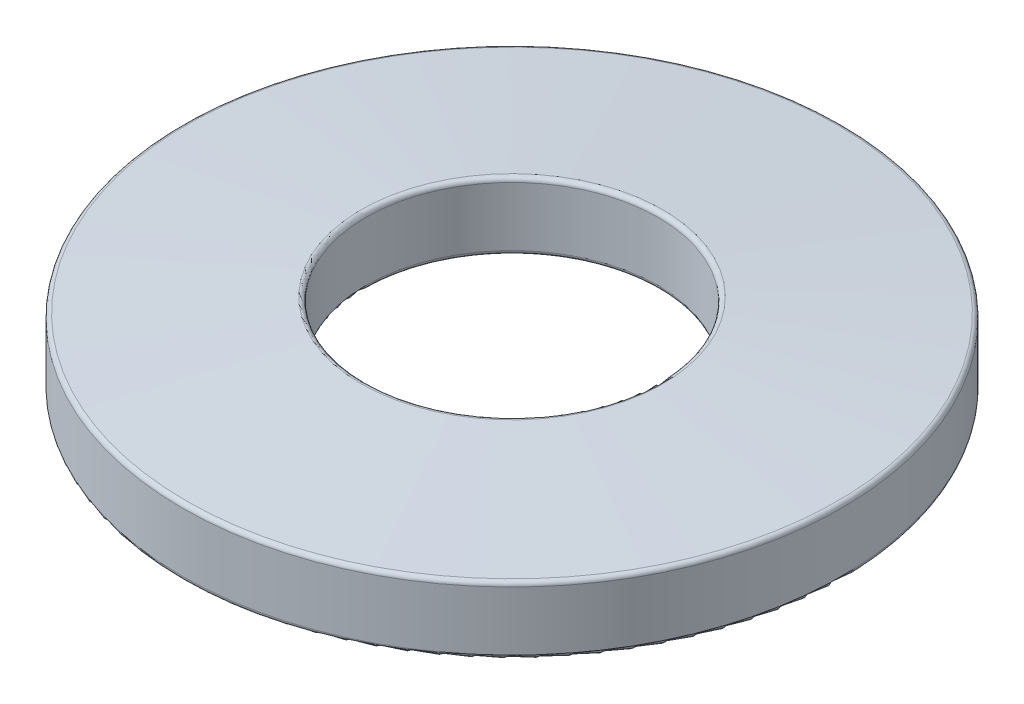
ISO-10303-21;
HEADER;
FILE_DESCRIPTION(('STEP AP214'),'2;1');
FILE_NAME('part.step','',(''),(''),'','','');
FILE_SCHEMA(('AUTOMOTIVE_DESIGN { 1 0 10303 214 1 1 1 1 }'));
ENDSEC;
DATA;
#1=APPLICATION_CONTEXT('core data for automotive mechanical design processes');
#2=APPLICATION_PROTOCOL_DEFINITION('international standard','automotive_design',2000,#1);
#3=PRODUCT_CONTEXT('',#1,'mechanical');
#4=PRODUCT('Part','Part','',(#3));
#5=PRODUCT_RELATED_PRODUCT_CATEGORY('part','',(#4));
#6=PRODUCT_DEFINITION_FORMATION('','',#4);
#7=PRODUCT_DEFINITION_CONTEXT('part definition',#1,'design');
#8=PRODUCT_DEFINITION('design','',#6,#7);
#9=PRODUCT_DEFINITION_SHAPE('','',#8);
#10=(LENGTH_UNIT() NAMED_UNIT(*) SI_UNIT(.MILLI.,.METRE.));
#11=(NAMED_UNIT(*) PLANE_ANGLE_UNIT() SI_UNIT($,.RADIAN.));
#12=(NAMED_UNIT(*) SI_UNIT($,.STERADIAN.) SOLID_ANGLE_UNIT());
#13=UNCERTAINTY_MEASURE_WITH_UNIT(LENGTH_MEASURE(1.E-05),#10,'distance_accuracy_value','');
#14=(GEOMETRIC_REPRESENTATION_CONTEXT(3) GLOBAL_UNCERTAINTY_ASSIGNED_CONTEXT((#13)) GLOBAL_UNIT_ASSIGNED_CONTEXT((#10,
#11,#12)) REPRESENTATION_CONTEXT('',''));
#15=CARTESIAN_POINT('',(0.,0.,0.));
#16=DIRECTION('',(0.,0.,1.));
#17=DIRECTION('',(1.,0.,0.));
#18=AXIS2_PLACEMENT_3D('',#15,#16,#17);
#19=CARTESIAN_POINT('',(0.,3.9624,0.));
#20=DIRECTION('',(0.,-1.,0.));
#21=DIRECTION('',(0.,0.,-1.));
#22=AXIS2_PLACEMENT_3D('',#19,#20,#21);
#23=CONICAL_SURFACE('',#22,19.304,1.49059050721893);
#24=CARTESIAN_POINT('',(0.,3.98118034265836,0.));
#25=DIRECTION('',(0.,1.,0.));
#26=DIRECTION('',(0.,0.,1.));
#27=AXIS2_PLACEMENT_3D('',#24,#25,#26);
#28=CIRCLE('',#27,19.0703504428092);
#29=CARTESIAN_POINT('',(0.,3.98118034265836,19.0703504428092));
#30=VERTEX_POINT('',#29);
#31=EDGE_CURVE('E48',#30,#30,#28,.T.);
#32=ORIENTED_EDGE('',*,*,#31,.T.);
#33=EDGE_LOOP('',(#32));
#34=FACE_BOUND('',#33,.T.);
#35=CARTESIAN_POINT('',(0.,4.80394819135812,0.));
#36=DIRECTION('',(0.,1.,0.));
#37=DIRECTION('',(0.,0.,1.));
#38=AXIS2_PLACEMENT_3D('',#35,#36,#37);
#39=CIRCLE('',#38,8.83415044280922);
#40=CARTESIAN_POINT('',(0.,4.80394819135812,8.83415044280922));
#41=VERTEX_POINT('',#40);
#42=EDGE_CURVE('E52',#41,#41,#39,.F.);
#43=ORIENTED_EDGE('',*,*,#42,.T.);
#44=EDGE_LOOP('',(#43));
#45=FACE_BOUND('',#44,.T.);
#46=ADVANCED_FACE('F37',(#34,#45),#23,.T.);
#47=CARTESIAN_POINT('',(0.,0.,0.));
#48=DIRECTION('',(0.,-1.,0.));
#49=DIRECTION('',(0.,0.,-1.));
#50=AXIS2_PLACEMENT_3D('',#47,#48,#49);
#51=CYLINDRICAL_SURFACE('',#50,8.5598);
#52=CARTESIAN_POINT('',(0.,1.09800310758566,0.));
#53=DIRECTION('',(0.,1.,0.));
#54=DIRECTION('',(0.,0.,1.));
#55=AXIS2_PLACEMENT_3D('',#52,#53,#54);
#56=CIRCLE('',#55,8.5598);
#57=CARTESIAN_POINT('',(0.,1.09800310758566,8.5598));
#58=VERTEX_POINT('',#57);
#59=EDGE_CURVE('E10',#58,#58,#56,.F.);
#60=ORIENTED_EDGE('',*,*,#59,.T.);
#61=EDGE_LOOP('',(#60));
#62=FACE_BOUND('',#61,.T.);
#63=CARTESIAN_POINT('',(0.,4.5507647411141,0.));
#64=DIRECTION('',(0.,1.,0.));
#65=DIRECTION('',(0.,0.,1.));
#66=AXIS2_PLACEMENT_3D('',#63,#64,#65);
#67=CIRCLE('',#66,8.5598);
#68=CARTESIAN_POINT('',(0.,4.5507647411141,8.5598));
#69=VERTEX_POINT('',#68);
#70=EDGE_CURVE('E44',#69,#69,#67,.T.);
#71=ORIENTED_EDGE('',*,*,#70,.T.);
#72=EDGE_LOOP('',(#71));
#73=FACE_BOUND('',#72,.T.);
#74=ADVANCED_FACE('F85',(#62,#73),#51,.F.);
#75=CARTESIAN_POINT('',(0.,0.8636,0.));
#76=DIRECTION('',(0.,-1.,0.));
#77=DIRECTION('',(0.,0.,-1.));
#78=AXIS2_PLACEMENT_3D('',#75,#76,#77);
#79=CONICAL_SURFACE('',#78,8.5598,1.49059050721893);
#80=CARTESIAN_POINT('',(0.,0.022051808641875,0.));
#81=DIRECTION('',(0.,1.,0.));
#82=DIRECTION('',(0.,0.,1.));
#83=AXIS2_PLACEMENT_3D('',#80,#81,#82);
#84=CIRCLE('',#83,19.0296495571908);
#85=CARTESIAN_POINT('',(0.,0.022051808641875,19.0296495571908));
#86=VERTEX_POINT('',#85);
#87=EDGE_CURVE('E63',#86,#86,#84,.F.);
#88=ORIENTED_EDGE('',*,*,#87,.T.);
#89=EDGE_LOOP('',(#88));
#90=FACE_BOUND('',#89,.T.);
#91=CARTESIAN_POINT('',(0.,0.844819657341639,0.));
#92=DIRECTION('',(0.,1.,0.));
#93=DIRECTION('',(0.,0.,1.));
#94=AXIS2_PLACEMENT_3D('',#91,#92,#93);
#95=CIRCLE('',#94,8.79344955719079);
#96=CARTESIAN_POINT('',(0.,0.844819657341639,8.79344955719079));
#97=VERTEX_POINT('',#96);
#98=EDGE_CURVE('E66',#97,#97,#95,.T.);
#99=ORIENTED_EDGE('',*,*,#98,.T.);
#100=EDGE_LOOP('',(#99));
#101=FACE_BOUND('',#100,.T.);
#102=ADVANCED_FACE('F70',(#90,#101),#79,.F.);
#103=CARTESIAN_POINT('',(0.,0.,0.));
#104=DIRECTION('',(0.,-1.,0.));
#105=DIRECTION('',(0.,0.,-1.));
#106=AXIS2_PLACEMENT_3D('',#103,#104,#105);
#107=CYLINDRICAL_SURFACE('',#106,19.304);
#108=CARTESIAN_POINT('',(0.,0.275235258885901,0.));
#109=DIRECTION('',(0.,1.,0.));
#110=DIRECTION('',(0.,0.,1.));
#111=AXIS2_PLACEMENT_3D('',#108,#109,#110);
#112=CIRCLE('',#111,19.304);
#113=CARTESIAN_POINT('',(0.,0.275235258885901,19.304));
#114=VERTEX_POINT('',#113);
#115=EDGE_CURVE('E57',#114,#114,#112,.T.);
#116=ORIENTED_EDGE('',*,*,#115,.T.);
#117=EDGE_LOOP('',(#116));
#118=FACE_BOUND('',#117,.T.);
#119=CARTESIAN_POINT('',(0.,3.72799689241434,0.));
#120=DIRECTION('',(0.,1.,0.));
#121=DIRECTION('',(0.,0.,1.));
#122=AXIS2_PLACEMENT_3D('',#119,#120,#121);
#123=CIRCLE('',#122,19.304);
#124=CARTESIAN_POINT('',(0.,3.72799689241434,19.304));
#125=VERTEX_POINT('',#124);
#126=EDGE_CURVE('E60',#125,#125,#123,.F.);
#127=ORIENTED_EDGE('',*,*,#126,.T.);
#128=EDGE_LOOP('',(#127));
#129=FACE_BOUND('',#128,.T.);
#130=ADVANCED_FACE('F96',(#118,#129),#107,.T.);
#131=CARTESIAN_POINT('',(0.,0.275235258885901,0.));
#132=DIRECTION('',(0.,1.,0.));
#133=DIRECTION('',(0.,0.,1.));
#134=AXIS2_PLACEMENT_3D('',#131,#132,#133);
#135=TOROIDAL_SURFACE('',#134,19.05,0.254);
#136=ORIENTED_EDGE('',*,*,#115,.F.);
#137=EDGE_LOOP('',(#136));
#138=FACE_BOUND('',#137,.T.);
#139=ORIENTED_EDGE('',*,*,#87,.F.);
#140=EDGE_LOOP('',(#139));
#141=FACE_BOUND('',#140,.T.);
#142=ADVANCED_FACE('F81',(#138,#141),#135,.T.);
#143=CARTESIAN_POINT('',(0.,3.72799689241434,0.));
#144=DIRECTION('',(0.,1.,0.));
#145=DIRECTION('',(0.,0.,1.));
#146=AXIS2_PLACEMENT_3D('',#143,#144,#145);
#147=TOROIDAL_SURFACE('',#146,19.05,0.254);
#148=ORIENTED_EDGE('',*,*,#31,.F.);
#149=EDGE_LOOP('',(#148));
#150=FACE_BOUND('',#149,.T.);
#151=ORIENTED_EDGE('',*,*,#126,.F.);
#152=EDGE_LOOP('',(#151));
#153=FACE_BOUND('',#152,.T.);
#154=ADVANCED_FACE('F75',(#150,#153),#147,.T.);
#155=CARTESIAN_POINT('',(0.,1.09800310758566,0.));
#156=DIRECTION('',(0.,1.,0.));
#157=DIRECTION('',(0.,0.,1.));
#158=AXIS2_PLACEMENT_3D('',#155,#156,#157);
#159=TOROIDAL_SURFACE('',#158,8.8138,0.254);
#160=ORIENTED_EDGE('',*,*,#98,.F.);
#161=EDGE_LOOP('',(#160));
#162=FACE_BOUND('',#161,.T.);
#163=ORIENTED_EDGE('',*,*,#59,.F.);
#164=EDGE_LOOP('',(#163));
#165=FACE_BOUND('',#164,.T.);
#166=ADVANCED_FACE('F72',(#162,#165),#159,.T.);
#167=CARTESIAN_POINT('',(0.,4.5507647411141,0.));
#168=DIRECTION('',(0.,1.,0.));
#169=DIRECTION('',(0.,0.,1.));
#170=AXIS2_PLACEMENT_3D('',#167,#168,#169);
#171=TOROIDAL_SURFACE('',#170,8.8138,0.254);
#172=ORIENTED_EDGE('',*,*,#70,.F.);
#173=EDGE_LOOP('',(#172));
#174=FACE_BOUND('',#173,.T.);
#175=ORIENTED_EDGE('',*,*,#42,.F.);
#176=EDGE_LOOP('',(#175));
#177=FACE_BOUND('',#176,.T.);
#178=ADVANCED_FACE('F39',(#174,#177),#171,.T.);
#179=CLOSED_SHELL('',(#46,#74,#102,#130,#142,#154,#166,#178));
#180=MANIFOLD_SOLID_BREP('B2',#179);
#181=ADVANCED_BREP_SHAPE_REPRESENTATION('',(#18,#180),#14);
#182=SHAPE_DEFINITION_REPRESENTATION(#9,#181);
ENDSEC;
END-ISO-10303-21;
